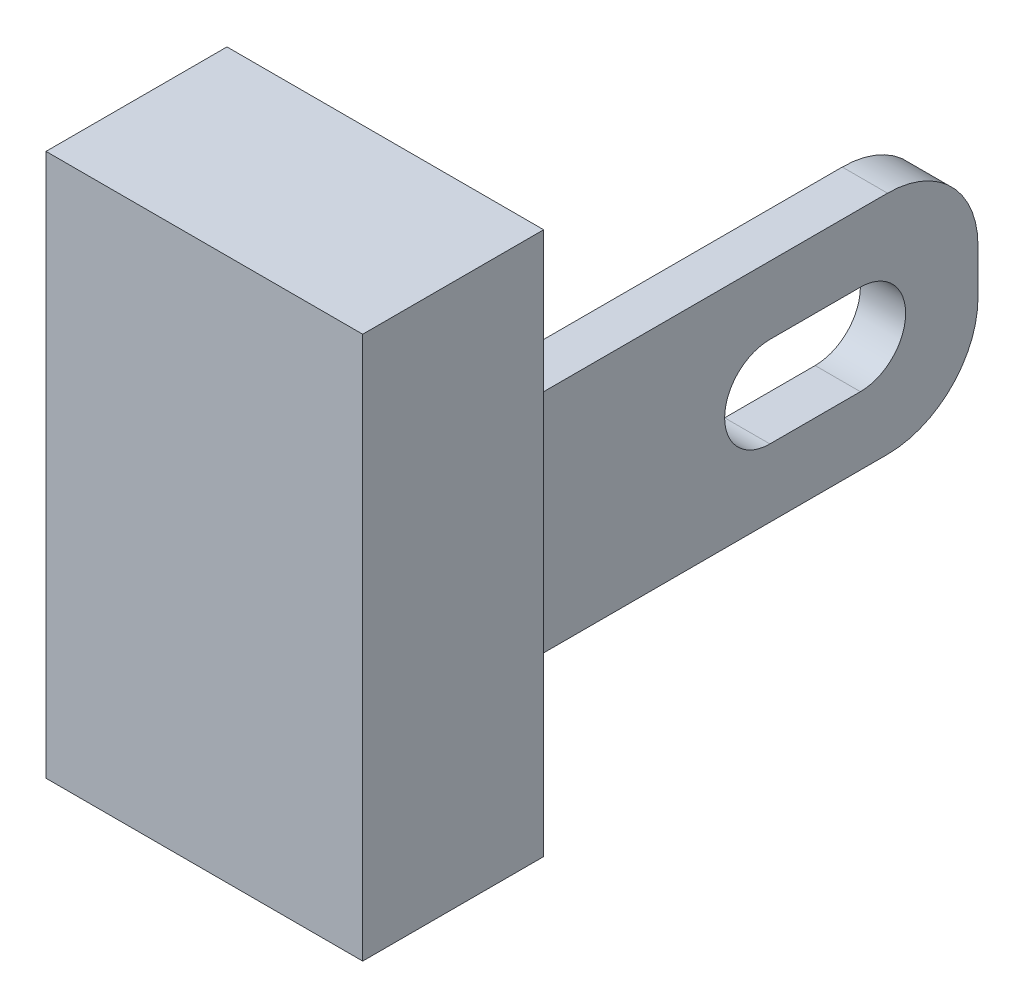
ISO-10303-21;
HEADER;
FILE_DESCRIPTION(('STEP AP214'),'2;1');
FILE_NAME('part.step','',(''),(''),'','','');
FILE_SCHEMA(('AUTOMOTIVE_DESIGN { 1 0 10303 214 1 1 1 1 }'));
ENDSEC;
DATA;
#1=APPLICATION_CONTEXT('core data for automotive mechanical design processes');
#2=APPLICATION_PROTOCOL_DEFINITION('international standard','automotive_design',2000,#1);
#3=PRODUCT_CONTEXT('',#1,'mechanical');
#4=PRODUCT('Part','Part','',(#3));
#5=PRODUCT_RELATED_PRODUCT_CATEGORY('part','',(#4));
#6=PRODUCT_DEFINITION_FORMATION('','',#4);
#7=PRODUCT_DEFINITION_CONTEXT('part definition',#1,'design');
#8=PRODUCT_DEFINITION('design','',#6,#7);
#9=PRODUCT_DEFINITION_SHAPE('','',#8);
#10=(LENGTH_UNIT() NAMED_UNIT(*) SI_UNIT(.MILLI.,.METRE.));
#11=(NAMED_UNIT(*) PLANE_ANGLE_UNIT() SI_UNIT($,.RADIAN.));
#12=(NAMED_UNIT(*) SI_UNIT($,.STERADIAN.) SOLID_ANGLE_UNIT());
#13=UNCERTAINTY_MEASURE_WITH_UNIT(LENGTH_MEASURE(1.E-05),#10,'distance_accuracy_value','');
#14=(GEOMETRIC_REPRESENTATION_CONTEXT(3) GLOBAL_UNCERTAINTY_ASSIGNED_CONTEXT((#13)) GLOBAL_UNIT_ASSIGNED_CONTEXT((#10,
#11,#12)) REPRESENTATION_CONTEXT('',''));
#15=CARTESIAN_POINT('',(0.,0.,0.));
#16=DIRECTION('',(0.,0.,1.));
#17=DIRECTION('',(1.,0.,0.));
#18=AXIS2_PLACEMENT_3D('',#15,#16,#17);
#19=CARTESIAN_POINT('',(0.,0.,0.));
#20=DIRECTION('',(0.,0.,1.));
#21=DIRECTION('',(1.,0.,0.));
#22=AXIS2_PLACEMENT_3D('',#19,#20,#21);
#23=PLANE('',#22);
#24=DIRECTION('',(0.,1.,0.));
#25=VECTOR('',#24,1.);
#26=CARTESIAN_POINT('',(1.75,3.,0.));
#27=LINE('',#26,#25);
#28=CARTESIAN_POINT('',(1.75,-3.,0.));
#29=VERTEX_POINT('',#28);
#30=CARTESIAN_POINT('',(1.75,3.,0.));
#31=VERTEX_POINT('',#30);
#32=EDGE_CURVE('E199',#29,#31,#27,.T.);
#33=ORIENTED_EDGE('',*,*,#32,.F.);
#34=DIRECTION('',(1.,0.,0.));
#35=VECTOR('',#34,1.);
#36=CARTESIAN_POINT('',(-1.75,-3.,0.));
#37=LINE('',#36,#35);
#38=CARTESIAN_POINT('',(-1.75,-3.,0.));
#39=VERTEX_POINT('',#38);
#40=EDGE_CURVE('E204',#39,#29,#37,.T.);
#41=ORIENTED_EDGE('',*,*,#40,.F.);
#42=DIRECTION('',(0.,-1.,0.));
#43=VECTOR('',#42,1.);
#44=CARTESIAN_POINT('',(-1.75,3.,0.));
#45=LINE('',#44,#43);
#46=CARTESIAN_POINT('',(-1.75,3.,0.));
#47=VERTEX_POINT('',#46);
#48=EDGE_CURVE('E215',#47,#39,#45,.T.);
#49=ORIENTED_EDGE('',*,*,#48,.F.);
#50=DIRECTION('',(-1.,0.,0.));
#51=VECTOR('',#50,1.);
#52=CARTESIAN_POINT('',(-1.75,3.,0.));
#53=LINE('',#52,#51);
#54=EDGE_CURVE('E213',#31,#47,#53,.T.);
#55=ORIENTED_EDGE('',*,*,#54,.F.);
#56=EDGE_LOOP('',(#33,#41,#49,#55));
#57=FACE_BOUND('',#56,.T.);
#58=DIRECTION('',(0.,1.,0.));
#59=VECTOR('',#58,1.);
#60=CARTESIAN_POINT('',(1.05,1.25,0.));
#61=LINE('',#60,#59);
#62=CARTESIAN_POINT('',(1.05,-1.25,0.));
#63=VERTEX_POINT('',#62);
#64=CARTESIAN_POINT('',(1.05,1.25,0.));
#65=VERTEX_POINT('',#64);
#66=EDGE_CURVE('E173',#63,#65,#61,.T.);
#67=ORIENTED_EDGE('',*,*,#66,.F.);
#68=DIRECTION('',(-1.,0.,0.));
#69=VECTOR('',#68,1.);
#70=CARTESIAN_POINT('',(1.55,-1.25,0.));
#71=LINE('',#70,#69);
#72=CARTESIAN_POINT('',(1.55,-1.25,0.));
#73=VERTEX_POINT('',#72);
#74=EDGE_CURVE('E178',#73,#63,#71,.T.);
#75=ORIENTED_EDGE('',*,*,#74,.F.);
#76=DIRECTION('',(0.,-1.,0.));
#77=VECTOR('',#76,1.);
#78=CARTESIAN_POINT('',(1.55,1.25,0.));
#79=LINE('',#78,#77);
#80=CARTESIAN_POINT('',(1.55,1.25,0.));
#81=VERTEX_POINT('',#80);
#82=EDGE_CURVE('E187',#81,#73,#79,.T.);
#83=ORIENTED_EDGE('',*,*,#82,.F.);
#84=DIRECTION('',(1.,0.,0.));
#85=VECTOR('',#84,1.);
#86=CARTESIAN_POINT('',(1.55,1.25,0.));
#87=LINE('',#86,#85);
#88=EDGE_CURVE('E184',#65,#81,#87,.T.);
#89=ORIENTED_EDGE('',*,*,#88,.F.);
#90=EDGE_LOOP('',(#67,#75,#83,#89));
#91=FACE_BOUND('',#90,.T.);
#92=ADVANCED_FACE('F36',(#57,#91),#23,.F.);
#93=CARTESIAN_POINT('',(1.75,3.,2.));
#94=DIRECTION('',(-1.,0.,0.));
#95=DIRECTION('',(0.,-1.,0.));
#96=AXIS2_PLACEMENT_3D('',#93,#94,#95);
#97=PLANE('',#96);
#98=ORIENTED_EDGE('',*,*,#32,.T.);
#99=DIRECTION('',(0.,0.,-1.));
#100=VECTOR('',#99,1.);
#101=CARTESIAN_POINT('',(1.75,3.,2.));
#102=LINE('',#101,#100);
#103=CARTESIAN_POINT('',(1.75,3.,2.));
#104=VERTEX_POINT('',#103);
#105=EDGE_CURVE('E226',#104,#31,#102,.T.);
#106=ORIENTED_EDGE('',*,*,#105,.F.);
#107=DIRECTION('',(0.,1.,0.));
#108=VECTOR('',#107,1.);
#109=CARTESIAN_POINT('',(1.75,3.,2.));
#110=LINE('',#109,#108);
#111=CARTESIAN_POINT('',(1.75,-3.,2.));
#112=VERTEX_POINT('',#111);
#113=EDGE_CURVE('E200',#112,#104,#110,.T.);
#114=ORIENTED_EDGE('',*,*,#113,.F.);
#115=DIRECTION('',(0.,0.,-1.));
#116=VECTOR('',#115,1.);
#117=CARTESIAN_POINT('',(1.75,-3.,2.));
#118=LINE('',#117,#116);
#119=EDGE_CURVE('E210',#112,#29,#118,.T.);
#120=ORIENTED_EDGE('',*,*,#119,.T.);
#121=EDGE_LOOP('',(#98,#106,#114,#120));
#122=FACE_BOUND('',#121,.T.);
#123=ADVANCED_FACE('F279',(#122),#97,.F.);
#124=CARTESIAN_POINT('',(-1.75,3.,2.));
#125=DIRECTION('',(0.,-1.,0.));
#126=DIRECTION('',(0.,0.,-1.));
#127=AXIS2_PLACEMENT_3D('',#124,#125,#126);
#128=PLANE('',#127);
#129=ORIENTED_EDGE('',*,*,#54,.T.);
#130=DIRECTION('',(0.,0.,-1.));
#131=VECTOR('',#130,1.);
#132=CARTESIAN_POINT('',(-1.75,3.,2.));
#133=LINE('',#132,#131);
#134=CARTESIAN_POINT('',(-1.75,3.,2.));
#135=VERTEX_POINT('',#134);
#136=EDGE_CURVE('E223',#135,#47,#133,.T.);
#137=ORIENTED_EDGE('',*,*,#136,.F.);
#138=DIRECTION('',(-1.,0.,0.));
#139=VECTOR('',#138,1.);
#140=CARTESIAN_POINT('',(-1.75,3.,2.));
#141=LINE('',#140,#139);
#142=EDGE_CURVE('E203',#104,#135,#141,.T.);
#143=ORIENTED_EDGE('',*,*,#142,.F.);
#144=ORIENTED_EDGE('',*,*,#105,.T.);
#145=EDGE_LOOP('',(#129,#137,#143,#144));
#146=FACE_BOUND('',#145,.T.);
#147=ADVANCED_FACE('F285',(#146),#128,.F.);
#148=CARTESIAN_POINT('',(-1.75,3.,2.));
#149=DIRECTION('',(1.,0.,0.));
#150=DIRECTION('',(0.,1.,0.));
#151=AXIS2_PLACEMENT_3D('',#148,#149,#150);
#152=PLANE('',#151);
#153=ORIENTED_EDGE('',*,*,#48,.T.);
#154=DIRECTION('',(0.,0.,-1.));
#155=VECTOR('',#154,1.);
#156=CARTESIAN_POINT('',(-1.75,-3.,2.));
#157=LINE('',#156,#155);
#158=CARTESIAN_POINT('',(-1.75,-3.,2.));
#159=VERTEX_POINT('',#158);
#160=EDGE_CURVE('E220',#159,#39,#157,.T.);
#161=ORIENTED_EDGE('',*,*,#160,.F.);
#162=DIRECTION('',(0.,-1.,0.));
#163=VECTOR('',#162,1.);
#164=CARTESIAN_POINT('',(-1.75,3.,2.));
#165=LINE('',#164,#163);
#166=EDGE_CURVE('E206',#135,#159,#165,.T.);
#167=ORIENTED_EDGE('',*,*,#166,.F.);
#168=ORIENTED_EDGE('',*,*,#136,.T.);
#169=EDGE_LOOP('',(#153,#161,#167,#168));
#170=FACE_BOUND('',#169,.T.);
#171=ADVANCED_FACE('F296',(#170),#152,.F.);
#172=CARTESIAN_POINT('',(-1.75,-3.,2.));
#173=DIRECTION('',(0.,1.,0.));
#174=DIRECTION('',(0.,0.,1.));
#175=AXIS2_PLACEMENT_3D('',#172,#173,#174);
#176=PLANE('',#175);
#177=ORIENTED_EDGE('',*,*,#40,.T.);
#178=ORIENTED_EDGE('',*,*,#119,.F.);
#179=DIRECTION('',(1.,0.,0.));
#180=VECTOR('',#179,1.);
#181=CARTESIAN_POINT('',(-1.75,-3.,2.));
#182=LINE('',#181,#180);
#183=EDGE_CURVE('E208',#159,#112,#182,.T.);
#184=ORIENTED_EDGE('',*,*,#183,.F.);
#185=ORIENTED_EDGE('',*,*,#160,.T.);
#186=EDGE_LOOP('',(#177,#178,#184,#185));
#187=FACE_BOUND('',#186,.T.);
#188=ADVANCED_FACE('F293',(#187),#176,.F.);
#189=CARTESIAN_POINT('',(0.,0.,2.));
#190=DIRECTION('',(0.,0.,1.));
#191=DIRECTION('',(1.,0.,0.));
#192=AXIS2_PLACEMENT_3D('',#189,#190,#191);
#193=PLANE('',#192);
#194=ORIENTED_EDGE('',*,*,#113,.T.);
#195=ORIENTED_EDGE('',*,*,#142,.T.);
#196=ORIENTED_EDGE('',*,*,#166,.T.);
#197=ORIENTED_EDGE('',*,*,#183,.T.);
#198=EDGE_LOOP('',(#194,#195,#196,#197));
#199=FACE_BOUND('',#198,.T.);
#200=ADVANCED_FACE('F291',(#199),#193,.T.);
#201=CARTESIAN_POINT('',(1.05,1.25,-5.));
#202=DIRECTION('',(1.,0.,0.));
#203=DIRECTION('',(0.,1.,0.));
#204=AXIS2_PLACEMENT_3D('',#201,#202,#203);
#205=PLANE('',#204);
#206=DIRECTION('',(0.,0.,1.));
#207=VECTOR('',#206,1.);
#208=CARTESIAN_POINT('',(1.05,0.5,-5.));
#209=LINE('',#208,#207);
#210=CARTESIAN_POINT('',(1.05,0.5,-3.7));
#211=VERTEX_POINT('',#210);
#212=CARTESIAN_POINT('',(1.05,0.5,-2.7));
#213=VERTEX_POINT('',#212);
#214=EDGE_CURVE('E167',#211,#213,#209,.T.);
#215=ORIENTED_EDGE('',*,*,#214,.T.);
#216=CARTESIAN_POINT('',(1.05,0.,-2.7));
#217=DIRECTION('',(1.,0.,0.));
#218=DIRECTION('',(0.,1.,0.));
#219=AXIS2_PLACEMENT_3D('',#216,#217,#218);
#220=CIRCLE('',#219,0.5);
#221=CARTESIAN_POINT('',(1.05,-0.5,-2.7));
#222=VERTEX_POINT('',#221);
#223=EDGE_CURVE('E170',#213,#222,#220,.T.);
#224=ORIENTED_EDGE('',*,*,#223,.T.);
#225=DIRECTION('',(0.,0.,-1.));
#226=VECTOR('',#225,1.);
#227=CARTESIAN_POINT('',(1.05,-0.5,-5.));
#228=LINE('',#227,#226);
#229=CARTESIAN_POINT('',(1.05,-0.5,-3.7));
#230=VERTEX_POINT('',#229);
#231=EDGE_CURVE('E162',#222,#230,#228,.T.);
#232=ORIENTED_EDGE('',*,*,#231,.T.);
#233=CARTESIAN_POINT('',(1.05,0.,-3.7));
#234=DIRECTION('',(1.,0.,0.));
#235=DIRECTION('',(0.,1.,0.));
#236=AXIS2_PLACEMENT_3D('',#233,#234,#235);
#237=CIRCLE('',#236,0.5);
#238=EDGE_CURVE('E142',#230,#211,#237,.T.);
#239=ORIENTED_EDGE('',*,*,#238,.T.);
#240=EDGE_LOOP('',(#215,#224,#232,#239));
#241=FACE_BOUND('',#240,.T.);
#242=DIRECTION('',(0.,1.,0.));
#243=VECTOR('',#242,1.);
#244=CARTESIAN_POINT('',(1.05,1.25,-5.));
#245=LINE('',#244,#243);
#246=CARTESIAN_POINT('',(1.05,-0.25,-5.));
#247=VERTEX_POINT('',#246);
#248=CARTESIAN_POINT('',(1.05,0.25,-5.));
#249=VERTEX_POINT('',#248);
#250=EDGE_CURVE('E174',#247,#249,#245,.T.);
#251=ORIENTED_EDGE('',*,*,#250,.F.);
#252=CARTESIAN_POINT('',(1.05,-0.25,-4.));
#253=DIRECTION('',(1.,0.,0.));
#254=DIRECTION('',(0.,1.,0.));
#255=AXIS2_PLACEMENT_3D('',#252,#253,#254);
#256=CIRCLE('',#255,1.);
#257=CARTESIAN_POINT('',(1.05,-1.25,-4.));
#258=VERTEX_POINT('',#257);
#259=EDGE_CURVE('E237',#247,#258,#256,.F.);
#260=ORIENTED_EDGE('',*,*,#259,.T.);
#261=DIRECTION('',(0.,0.,1.));
#262=VECTOR('',#261,1.);
#263=CARTESIAN_POINT('',(1.05,-1.25,-5.));
#264=LINE('',#263,#262);
#265=EDGE_CURVE('E181',#258,#63,#264,.T.);
#266=ORIENTED_EDGE('',*,*,#265,.T.);
#267=ORIENTED_EDGE('',*,*,#66,.T.);
#268=DIRECTION('',(0.,0.,1.));
#269=VECTOR('',#268,1.);
#270=CARTESIAN_POINT('',(1.05,1.25,-5.));
#271=LINE('',#270,#269);
#272=CARTESIAN_POINT('',(1.05,1.25,-4.));
#273=VERTEX_POINT('',#272);
#274=EDGE_CURVE('E197',#273,#65,#271,.T.);
#275=ORIENTED_EDGE('',*,*,#274,.F.);
#276=CARTESIAN_POINT('',(1.05,0.25,-4.));
#277=DIRECTION('',(1.,0.,0.));
#278=DIRECTION('',(0.,1.,0.));
#279=AXIS2_PLACEMENT_3D('',#276,#277,#278);
#280=CIRCLE('',#279,1.);
#281=EDGE_CURVE('E235',#273,#249,#280,.F.);
#282=ORIENTED_EDGE('',*,*,#281,.T.);
#283=EDGE_LOOP('',(#251,#260,#266,#267,#275,#282));
#284=FACE_BOUND('',#283,.T.);
#285=ADVANCED_FACE('F255',(#241,#284),#205,.F.);
#286=CARTESIAN_POINT('',(1.55,1.25,-5.));
#287=DIRECTION('',(0.,-1.,0.));
#288=DIRECTION('',(1.,0.,0.));
#289=AXIS2_PLACEMENT_3D('',#286,#287,#288);
#290=PLANE('',#289);
#291=DIRECTION('',(0.,0.,1.));
#292=VECTOR('',#291,1.);
#293=CARTESIAN_POINT('',(1.55,1.25,-5.));
#294=LINE('',#293,#292);
#295=CARTESIAN_POINT('',(1.55,1.25,-4.));
#296=VERTEX_POINT('',#295);
#297=EDGE_CURVE('E195',#296,#81,#294,.T.);
#298=ORIENTED_EDGE('',*,*,#297,.F.);
#299=DIRECTION('',(1.,0.,0.));
#300=VECTOR('',#299,1.);
#301=CARTESIAN_POINT('',(1.05,1.25,-4.));
#302=LINE('',#301,#300);
#303=EDGE_CURVE('E11',#296,#273,#302,.F.);
#304=ORIENTED_EDGE('',*,*,#303,.T.);
#305=ORIENTED_EDGE('',*,*,#274,.T.);
#306=ORIENTED_EDGE('',*,*,#88,.T.);
#307=EDGE_LOOP('',(#298,#304,#305,#306));
#308=FACE_BOUND('',#307,.T.);
#309=ADVANCED_FACE('F266',(#308),#290,.F.);
#310=CARTESIAN_POINT('',(1.55,1.25,-5.));
#311=DIRECTION('',(-1.,0.,0.));
#312=DIRECTION('',(0.,-1.,0.));
#313=AXIS2_PLACEMENT_3D('',#310,#311,#312);
#314=PLANE('',#313);
#315=DIRECTION('',(0.,0.,-1.));
#316=VECTOR('',#315,1.);
#317=CARTESIAN_POINT('',(1.55,-0.5,-2.7));
#318=LINE('',#317,#316);
#319=CARTESIAN_POINT('',(1.55,-0.5,-2.7));
#320=VERTEX_POINT('',#319);
#321=CARTESIAN_POINT('',(1.55,-0.5,-3.7));
#322=VERTEX_POINT('',#321);
#323=EDGE_CURVE('E148',#320,#322,#318,.T.);
#324=ORIENTED_EDGE('',*,*,#323,.F.);
#325=CARTESIAN_POINT('',(1.55,0.,-2.7));
#326=DIRECTION('',(1.,0.,0.));
#327=DIRECTION('',(0.,1.,0.));
#328=AXIS2_PLACEMENT_3D('',#325,#326,#327);
#329=CIRCLE('',#328,0.5);
#330=CARTESIAN_POINT('',(1.55,0.5,-2.7));
#331=VERTEX_POINT('',#330);
#332=EDGE_CURVE('E59',#331,#320,#329,.T.);
#333=ORIENTED_EDGE('',*,*,#332,.F.);
#334=DIRECTION('',(0.,0.,1.));
#335=VECTOR('',#334,1.);
#336=CARTESIAN_POINT('',(1.55,0.5,-2.7));
#337=LINE('',#336,#335);
#338=CARTESIAN_POINT('',(1.55,0.5,-3.7));
#339=VERTEX_POINT('',#338);
#340=EDGE_CURVE('E155',#339,#331,#337,.T.);
#341=ORIENTED_EDGE('',*,*,#340,.F.);
#342=CARTESIAN_POINT('',(1.55,0.,-3.7));
#343=DIRECTION('',(1.,0.,0.));
#344=DIRECTION('',(0.,1.,0.));
#345=AXIS2_PLACEMENT_3D('',#342,#343,#344);
#346=CIRCLE('',#345,0.5);
#347=EDGE_CURVE('E139',#322,#339,#346,.T.);
#348=ORIENTED_EDGE('',*,*,#347,.F.);
#349=EDGE_LOOP('',(#324,#333,#341,#348));
#350=FACE_BOUND('',#349,.T.);
#351=DIRECTION('',(0.,0.,1.));
#352=VECTOR('',#351,1.);
#353=CARTESIAN_POINT('',(1.55,-1.25,-5.));
#354=LINE('',#353,#352);
#355=CARTESIAN_POINT('',(1.55,-1.25,-4.));
#356=VERTEX_POINT('',#355);
#357=EDGE_CURVE('E193',#356,#73,#354,.T.);
#358=ORIENTED_EDGE('',*,*,#357,.F.);
#359=CARTESIAN_POINT('',(1.55,-0.25,-4.));
#360=DIRECTION('',(-1.,0.,0.));
#361=DIRECTION('',(0.,-1.,0.));
#362=AXIS2_PLACEMENT_3D('',#359,#360,#361);
#363=CIRCLE('',#362,1.);
#364=CARTESIAN_POINT('',(1.55,-0.25,-5.));
#365=VERTEX_POINT('',#364);
#366=EDGE_CURVE('E44',#356,#365,#363,.F.);
#367=ORIENTED_EDGE('',*,*,#366,.T.);
#368=DIRECTION('',(0.,-1.,0.));
#369=VECTOR('',#368,1.);
#370=CARTESIAN_POINT('',(1.55,1.25,-5.));
#371=LINE('',#370,#369);
#372=CARTESIAN_POINT('',(1.55,0.25,-5.));
#373=VERTEX_POINT('',#372);
#374=EDGE_CURVE('E177',#373,#365,#371,.T.);
#375=ORIENTED_EDGE('',*,*,#374,.F.);
#376=CARTESIAN_POINT('',(1.55,0.25,-4.));
#377=DIRECTION('',(-1.,0.,0.));
#378=DIRECTION('',(0.,-1.,0.));
#379=AXIS2_PLACEMENT_3D('',#376,#377,#378);
#380=CIRCLE('',#379,1.);
#381=EDGE_CURVE('E241',#373,#296,#380,.F.);
#382=ORIENTED_EDGE('',*,*,#381,.T.);
#383=ORIENTED_EDGE('',*,*,#297,.T.);
#384=ORIENTED_EDGE('',*,*,#82,.T.);
#385=EDGE_LOOP('',(#358,#367,#375,#382,#383,#384));
#386=FACE_BOUND('',#385,.T.);
#387=ADVANCED_FACE('F152',(#350,#386),#314,.F.);
#388=CARTESIAN_POINT('',(1.55,-1.25,-5.));
#389=DIRECTION('',(0.,1.,0.));
#390=DIRECTION('',(0.,0.,1.));
#391=AXIS2_PLACEMENT_3D('',#388,#389,#390);
#392=PLANE('',#391);
#393=ORIENTED_EDGE('',*,*,#265,.F.);
#394=DIRECTION('',(-1.,0.,0.));
#395=VECTOR('',#394,1.);
#396=CARTESIAN_POINT('',(1.55,-1.25,-4.));
#397=LINE('',#396,#395);
#398=EDGE_CURVE('E239',#258,#356,#397,.F.);
#399=ORIENTED_EDGE('',*,*,#398,.T.);
#400=ORIENTED_EDGE('',*,*,#357,.T.);
#401=ORIENTED_EDGE('',*,*,#74,.T.);
#402=EDGE_LOOP('',(#393,#399,#400,#401));
#403=FACE_BOUND('',#402,.T.);
#404=ADVANCED_FACE('F258',(#403),#392,.F.);
#405=CARTESIAN_POINT('',(0.,0.,-5.));
#406=DIRECTION('',(0.,0.,-1.));
#407=DIRECTION('',(-1.,0.,0.));
#408=AXIS2_PLACEMENT_3D('',#405,#406,#407);
#409=PLANE('',#408);
#410=ORIENTED_EDGE('',*,*,#374,.T.);
#411=DIRECTION('',(-1.,0.,0.));
#412=VECTOR('',#411,1.);
#413=CARTESIAN_POINT('',(1.05,-0.25,-5.));
#414=LINE('',#413,#412);
#415=EDGE_CURVE('E232',#365,#247,#414,.T.);
#416=ORIENTED_EDGE('',*,*,#415,.T.);
#417=ORIENTED_EDGE('',*,*,#250,.T.);
#418=DIRECTION('',(1.,0.,0.));
#419=VECTOR('',#418,1.);
#420=CARTESIAN_POINT('',(1.55,0.25,-5.));
#421=LINE('',#420,#419);
#422=EDGE_CURVE('E229',#249,#373,#421,.T.);
#423=ORIENTED_EDGE('',*,*,#422,.T.);
#424=EDGE_LOOP('',(#410,#416,#417,#423));
#425=FACE_BOUND('',#424,.T.);
#426=ADVANCED_FACE('F249',(#425),#409,.T.);
#427=CARTESIAN_POINT('',(0.,-0.25,-4.));
#428=DIRECTION('',(1.,0.,0.));
#429=DIRECTION('',(0.,0.,-1.));
#430=AXIS2_PLACEMENT_3D('',#427,#428,#429);
#431=CYLINDRICAL_SURFACE('',#430,1.);
#432=ORIENTED_EDGE('',*,*,#366,.F.);
#433=ORIENTED_EDGE('',*,*,#398,.F.);
#434=ORIENTED_EDGE('',*,*,#259,.F.);
#435=ORIENTED_EDGE('',*,*,#415,.F.);
#436=EDGE_LOOP('',(#432,#433,#434,#435));
#437=FACE_BOUND('',#436,.T.);
#438=ADVANCED_FACE('F252',(#437),#431,.T.);
#439=CARTESIAN_POINT('',(0.,0.249999999999999,-4.));
#440=DIRECTION('',(-1.,0.,0.));
#441=DIRECTION('',(0.,-1.,0.));
#442=AXIS2_PLACEMENT_3D('',#439,#440,#441);
#443=CYLINDRICAL_SURFACE('',#442,1.);
#444=ORIENTED_EDGE('',*,*,#281,.F.);
#445=ORIENTED_EDGE('',*,*,#303,.F.);
#446=ORIENTED_EDGE('',*,*,#381,.F.);
#447=ORIENTED_EDGE('',*,*,#422,.F.);
#448=EDGE_LOOP('',(#444,#445,#446,#447));
#449=FACE_BOUND('',#448,.T.);
#450=ADVANCED_FACE('F38',(#449),#443,.T.);
#451=CARTESIAN_POINT('',(-1.75,0.,-2.7));
#452=DIRECTION('',(1.,0.,0.));
#453=DIRECTION('',(0.,1.,0.));
#454=AXIS2_PLACEMENT_3D('',#451,#452,#453);
#455=CYLINDRICAL_SURFACE('',#454,0.5);
#456=DIRECTION('',(1.,0.,0.));
#457=VECTOR('',#456,1.);
#458=CARTESIAN_POINT('',(-1.75,0.5,-2.7));
#459=LINE('',#458,#457);
#460=EDGE_CURVE('E160',#213,#331,#459,.T.);
#461=ORIENTED_EDGE('',*,*,#460,.T.);
#462=ORIENTED_EDGE('',*,*,#332,.T.);
#463=DIRECTION('',(1.,0.,0.));
#464=VECTOR('',#463,1.);
#465=CARTESIAN_POINT('',(-1.75,-0.5,-2.7));
#466=LINE('',#465,#464);
#467=EDGE_CURVE('E145',#222,#320,#466,.T.);
#468=ORIENTED_EDGE('',*,*,#467,.F.);
#469=ORIENTED_EDGE('',*,*,#223,.F.);
#470=EDGE_LOOP('',(#461,#462,#468,#469));
#471=FACE_BOUND('',#470,.T.);
#472=ADVANCED_FACE('F271',(#471),#455,.F.);
#473=CARTESIAN_POINT('',(-1.75,0.5,-2.7));
#474=DIRECTION('',(0.,1.,0.));
#475=DIRECTION('',(-1.,0.,0.));
#476=AXIS2_PLACEMENT_3D('',#473,#474,#475);
#477=PLANE('',#476);
#478=DIRECTION('',(1.,0.,0.));
#479=VECTOR('',#478,1.);
#480=CARTESIAN_POINT('',(-1.75,0.5,-3.7));
#481=LINE('',#480,#479);
#482=EDGE_CURVE('E144',#211,#339,#481,.T.);
#483=ORIENTED_EDGE('',*,*,#482,.T.);
#484=ORIENTED_EDGE('',*,*,#340,.T.);
#485=ORIENTED_EDGE('',*,*,#460,.F.);
#486=ORIENTED_EDGE('',*,*,#214,.F.);
#487=EDGE_LOOP('',(#483,#484,#485,#486));
#488=FACE_BOUND('',#487,.T.);
#489=ADVANCED_FACE('F276',(#488),#477,.F.);
#490=CARTESIAN_POINT('',(-1.75,0.,-3.7));
#491=DIRECTION('',(1.,0.,0.));
#492=DIRECTION('',(0.,1.,0.));
#493=AXIS2_PLACEMENT_3D('',#490,#491,#492);
#494=CYLINDRICAL_SURFACE('',#493,0.5);
#495=DIRECTION('',(1.,0.,0.));
#496=VECTOR('',#495,1.);
#497=CARTESIAN_POINT('',(-1.75,-0.5,-3.7));
#498=LINE('',#497,#496);
#499=EDGE_CURVE('E51',#230,#322,#498,.T.);
#500=ORIENTED_EDGE('',*,*,#499,.T.);
#501=ORIENTED_EDGE('',*,*,#347,.T.);
#502=ORIENTED_EDGE('',*,*,#482,.F.);
#503=ORIENTED_EDGE('',*,*,#238,.F.);
#504=EDGE_LOOP('',(#500,#501,#502,#503));
#505=FACE_BOUND('',#504,.T.);
#506=ADVANCED_FACE('F136',(#505),#494,.F.);
#507=CARTESIAN_POINT('',(-1.75,-0.5,-2.7));
#508=DIRECTION('',(0.,-1.,0.));
#509=DIRECTION('',(1.,0.,0.));
#510=AXIS2_PLACEMENT_3D('',#507,#508,#509);
#511=PLANE('',#510);
#512=ORIENTED_EDGE('',*,*,#467,.T.);
#513=ORIENTED_EDGE('',*,*,#323,.T.);
#514=ORIENTED_EDGE('',*,*,#499,.F.);
#515=ORIENTED_EDGE('',*,*,#231,.F.);
#516=EDGE_LOOP('',(#512,#513,#514,#515));
#517=FACE_BOUND('',#516,.T.);
#518=ADVANCED_FACE('F149',(#517),#511,.F.);
#519=CLOSED_SHELL('',(#92,#123,#147,#171,#188,#200,#285,#309,#387,#404,#426,#438,#450,#472,#489,
#506,#518));
#520=MANIFOLD_SOLID_BREP('B2',#519);
#521=ADVANCED_BREP_SHAPE_REPRESENTATION('',(#18,#520),#14);
#522=SHAPE_DEFINITION_REPRESENTATION(#9,#521);
ENDSEC;
END-ISO-10303-21;
